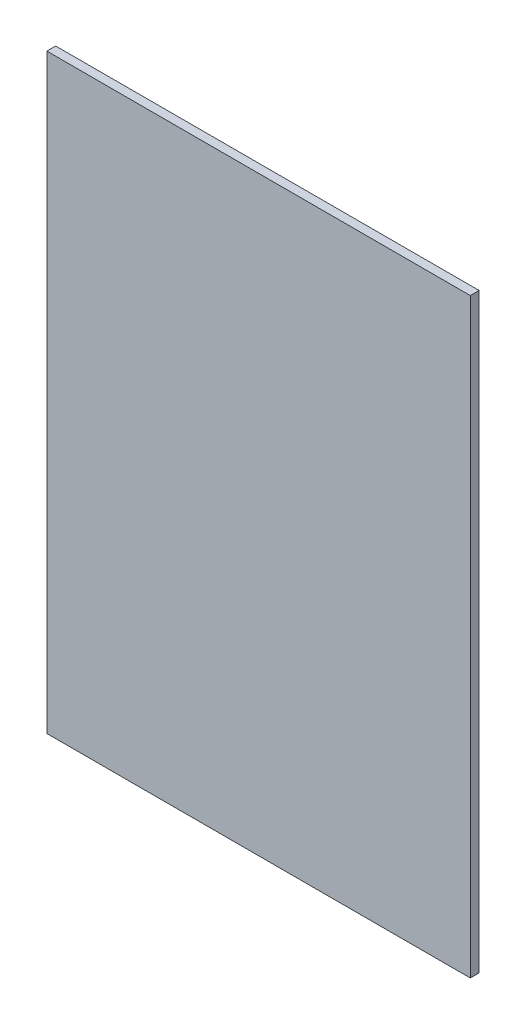
ISO-10303-21;
HEADER;
FILE_DESCRIPTION(('STEP AP214'),'2;1');
FILE_NAME('part.step','',(''),(''),'','','');
FILE_SCHEMA(('AUTOMOTIVE_DESIGN { 1 0 10303 214 1 1 1 1 }'));
ENDSEC;
DATA;
#1=APPLICATION_CONTEXT('core data for automotive mechanical design processes');
#2=APPLICATION_PROTOCOL_DEFINITION('international standard','automotive_design',2000,#1);
#3=PRODUCT_CONTEXT('',#1,'mechanical');
#4=PRODUCT('Part','Part','',(#3));
#5=PRODUCT_RELATED_PRODUCT_CATEGORY('part','',(#4));
#6=PRODUCT_DEFINITION_FORMATION('','',#4);
#7=PRODUCT_DEFINITION_CONTEXT('part definition',#1,'design');
#8=PRODUCT_DEFINITION('design','',#6,#7);
#9=PRODUCT_DEFINITION_SHAPE('','',#8);
#10=(LENGTH_UNIT() NAMED_UNIT(*) SI_UNIT(.MILLI.,.METRE.));
#11=(NAMED_UNIT(*) PLANE_ANGLE_UNIT() SI_UNIT($,.RADIAN.));
#12=(NAMED_UNIT(*) SI_UNIT($,.STERADIAN.) SOLID_ANGLE_UNIT());
#13=UNCERTAINTY_MEASURE_WITH_UNIT(LENGTH_MEASURE(1.E-05),#10,'distance_accuracy_value','');
#14=(GEOMETRIC_REPRESENTATION_CONTEXT(3) GLOBAL_UNCERTAINTY_ASSIGNED_CONTEXT((#13)) GLOBAL_UNIT_ASSIGNED_CONTEXT((#10,
#11,#12)) REPRESENTATION_CONTEXT('',''));
#15=CARTESIAN_POINT('',(0.,0.,0.));
#16=DIRECTION('',(0.,0.,1.));
#17=DIRECTION('',(1.,0.,0.));
#18=AXIS2_PLACEMENT_3D('',#15,#16,#17);
#19=CARTESIAN_POINT('',(-290.,335.,10.));
#20=DIRECTION('',(1.,0.,0.));
#21=DIRECTION('',(0.,1.,0.));
#22=AXIS2_PLACEMENT_3D('',#19,#20,#21);
#23=PLANE('',#22);
#24=DIRECTION('',(0.,-1.,0.));
#25=VECTOR('',#24,1.);
#26=CARTESIAN_POINT('',(-290.,335.,0.));
#27=LINE('',#26,#25);
#28=CARTESIAN_POINT('',(-290.,335.,0.));
#29=VERTEX_POINT('',#28);
#30=CARTESIAN_POINT('',(-290.,-335.,0.));
#31=VERTEX_POINT('',#30);
#32=EDGE_CURVE('E96',#29,#31,#27,.T.);
#33=ORIENTED_EDGE('',*,*,#32,.T.);
#34=DIRECTION('',(0.,0.,-1.));
#35=VECTOR('',#34,1.);
#36=CARTESIAN_POINT('',(-290.,-335.,10.));
#37=LINE('',#36,#35);
#38=CARTESIAN_POINT('',(-290.,-335.,10.));
#39=VERTEX_POINT('',#38);
#40=EDGE_CURVE('E11',#39,#31,#37,.T.);
#41=ORIENTED_EDGE('',*,*,#40,.F.);
#42=DIRECTION('',(0.,-1.,0.));
#43=VECTOR('',#42,1.);
#44=CARTESIAN_POINT('',(-290.,335.,10.));
#45=LINE('',#44,#43);
#46=CARTESIAN_POINT('',(-290.,335.,10.));
#47=VERTEX_POINT('',#46);
#48=EDGE_CURVE('E84',#47,#39,#45,.T.);
#49=ORIENTED_EDGE('',*,*,#48,.F.);
#50=DIRECTION('',(0.,0.,-1.));
#51=VECTOR('',#50,1.);
#52=CARTESIAN_POINT('',(-290.,335.,10.));
#53=LINE('',#52,#51);
#54=EDGE_CURVE('E92',#47,#29,#53,.T.);
#55=ORIENTED_EDGE('',*,*,#54,.T.);
#56=EDGE_LOOP('',(#33,#41,#49,#55));
#57=FACE_BOUND('',#56,.T.);
#58=ADVANCED_FACE('F33',(#57),#23,.F.);
#59=CARTESIAN_POINT('',(-290.,-335.,10.));
#60=DIRECTION('',(0.,1.,0.));
#61=DIRECTION('',(0.,0.,1.));
#62=AXIS2_PLACEMENT_3D('',#59,#60,#61);
#63=PLANE('',#62);
#64=DIRECTION('',(1.,0.,0.));
#65=VECTOR('',#64,1.);
#66=CARTESIAN_POINT('',(-290.,-335.,0.));
#67=LINE('',#66,#65);
#68=CARTESIAN_POINT('',(190.,-335.,0.));
#69=VERTEX_POINT('',#68);
#70=EDGE_CURVE('E88',#31,#69,#67,.T.);
#71=ORIENTED_EDGE('',*,*,#70,.T.);
#72=DIRECTION('',(0.,0.,-1.));
#73=VECTOR('',#72,1.);
#74=CARTESIAN_POINT('',(190.,-335.,10.));
#75=LINE('',#74,#73);
#76=CARTESIAN_POINT('',(190.,-335.,10.));
#77=VERTEX_POINT('',#76);
#78=EDGE_CURVE('E41',#77,#69,#75,.T.);
#79=ORIENTED_EDGE('',*,*,#78,.F.);
#80=DIRECTION('',(1.,0.,0.));
#81=VECTOR('',#80,1.);
#82=CARTESIAN_POINT('',(-290.,-335.,10.));
#83=LINE('',#82,#81);
#84=EDGE_CURVE('E79',#39,#77,#83,.T.);
#85=ORIENTED_EDGE('',*,*,#84,.F.);
#86=ORIENTED_EDGE('',*,*,#40,.T.);
#87=EDGE_LOOP('',(#71,#79,#85,#86));
#88=FACE_BOUND('',#87,.T.);
#89=ADVANCED_FACE('F87',(#88),#63,.F.);
#90=CARTESIAN_POINT('',(190.,335.,10.));
#91=DIRECTION('',(-1.,0.,0.));
#92=DIRECTION('',(0.,-1.,0.));
#93=AXIS2_PLACEMENT_3D('',#90,#91,#92);
#94=PLANE('',#93);
#95=DIRECTION('',(0.,1.,0.));
#96=VECTOR('',#95,1.);
#97=CARTESIAN_POINT('',(190.,335.,0.));
#98=LINE('',#97,#96);
#99=CARTESIAN_POINT('',(190.,335.,0.));
#100=VERTEX_POINT('',#99);
#101=EDGE_CURVE('E66',#69,#100,#98,.T.);
#102=ORIENTED_EDGE('',*,*,#101,.T.);
#103=DIRECTION('',(0.,0.,-1.));
#104=VECTOR('',#103,1.);
#105=CARTESIAN_POINT('',(190.,335.,10.));
#106=LINE('',#105,#104);
#107=CARTESIAN_POINT('',(190.,335.,10.));
#108=VERTEX_POINT('',#107);
#109=EDGE_CURVE('E89',#108,#100,#106,.T.);
#110=ORIENTED_EDGE('',*,*,#109,.F.);
#111=DIRECTION('',(0.,1.,0.));
#112=VECTOR('',#111,1.);
#113=CARTESIAN_POINT('',(190.,335.,10.));
#114=LINE('',#113,#112);
#115=EDGE_CURVE('E82',#77,#108,#114,.T.);
#116=ORIENTED_EDGE('',*,*,#115,.F.);
#117=ORIENTED_EDGE('',*,*,#78,.T.);
#118=EDGE_LOOP('',(#102,#110,#116,#117));
#119=FACE_BOUND('',#118,.T.);
#120=ADVANCED_FACE('F90',(#119),#94,.F.);
#121=CARTESIAN_POINT('',(-290.,335.,10.));
#122=DIRECTION('',(0.,-1.,0.));
#123=DIRECTION('',(0.,0.,-1.));
#124=AXIS2_PLACEMENT_3D('',#121,#122,#123);
#125=PLANE('',#124);
#126=DIRECTION('',(-1.,0.,0.));
#127=VECTOR('',#126,1.);
#128=CARTESIAN_POINT('',(-290.,335.,0.));
#129=LINE('',#128,#127);
#130=EDGE_CURVE('E72',#100,#29,#129,.T.);
#131=ORIENTED_EDGE('',*,*,#130,.T.);
#132=ORIENTED_EDGE('',*,*,#54,.F.);
#133=DIRECTION('',(-1.,0.,0.));
#134=VECTOR('',#133,1.);
#135=CARTESIAN_POINT('',(-290.,335.,10.));
#136=LINE('',#135,#134);
#137=EDGE_CURVE('E49',#108,#47,#136,.T.);
#138=ORIENTED_EDGE('',*,*,#137,.F.);
#139=ORIENTED_EDGE('',*,*,#109,.T.);
#140=EDGE_LOOP('',(#131,#132,#138,#139));
#141=FACE_BOUND('',#140,.T.);
#142=ADVANCED_FACE('F103',(#141),#125,.F.);
#143=CARTESIAN_POINT('',(0.,0.,10.));
#144=DIRECTION('',(0.,0.,1.));
#145=DIRECTION('',(1.,0.,0.));
#146=AXIS2_PLACEMENT_3D('',#143,#144,#145);
#147=PLANE('',#146);
#148=ORIENTED_EDGE('',*,*,#48,.T.);
#149=ORIENTED_EDGE('',*,*,#84,.T.);
#150=ORIENTED_EDGE('',*,*,#115,.T.);
#151=ORIENTED_EDGE('',*,*,#137,.T.);
#152=EDGE_LOOP('',(#148,#149,#150,#151));
#153=FACE_BOUND('',#152,.T.);
#154=ADVANCED_FACE('F80',(#153),#147,.T.);
#155=CARTESIAN_POINT('',(0.,0.,0.));
#156=DIRECTION('',(0.,0.,1.));
#157=DIRECTION('',(1.,0.,0.));
#158=AXIS2_PLACEMENT_3D('',#155,#156,#157);
#159=PLANE('',#158);
#160=ORIENTED_EDGE('',*,*,#32,.F.);
#161=ORIENTED_EDGE('',*,*,#130,.F.);
#162=ORIENTED_EDGE('',*,*,#101,.F.);
#163=ORIENTED_EDGE('',*,*,#70,.F.);
#164=EDGE_LOOP('',(#160,#161,#162,#163));
#165=FACE_BOUND('',#164,.T.);
#166=ADVANCED_FACE('F106',(#165),#159,.F.);
#167=CLOSED_SHELL('',(#58,#89,#120,#142,#154,#166));
#168=MANIFOLD_SOLID_BREP('B2',#167);
#169=ADVANCED_BREP_SHAPE_REPRESENTATION('',(#18,#168),#14);
#170=SHAPE_DEFINITION_REPRESENTATION(#9,#169);
ENDSEC;
END-ISO-10303-21;
